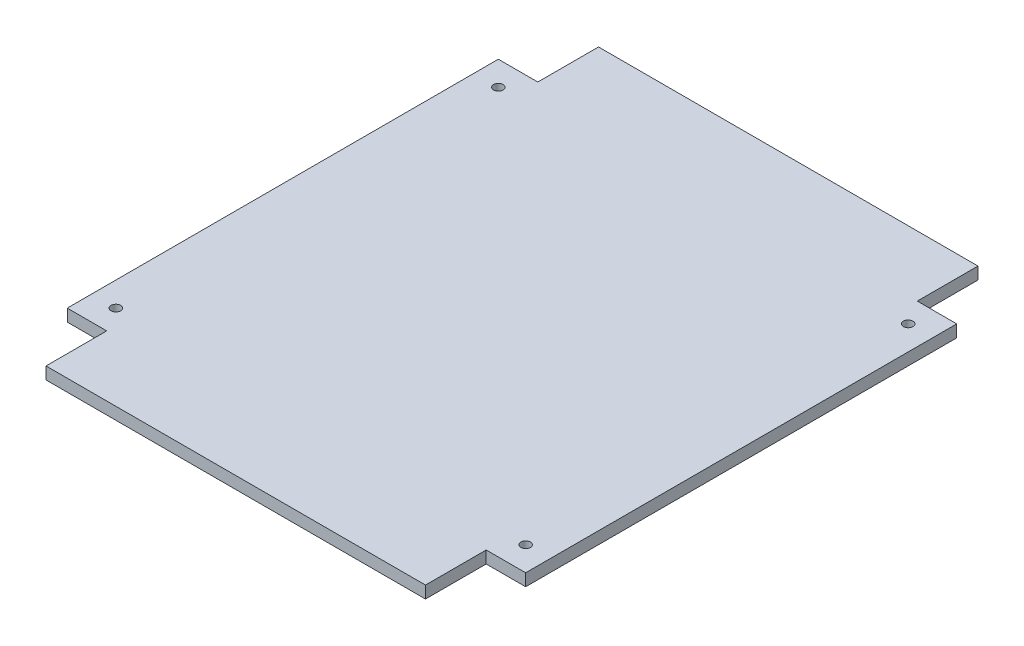
ISO-10303-21;
HEADER;
FILE_DESCRIPTION(('STEP AP214'),'2;1');
FILE_NAME('part.step','',(''),(''),'','','');
FILE_SCHEMA(('AUTOMOTIVE_DESIGN { 1 0 10303 214 1 1 1 1 }'));
ENDSEC;
DATA;
#1=APPLICATION_CONTEXT('core data for automotive mechanical design processes');
#2=APPLICATION_PROTOCOL_DEFINITION('international standard','automotive_design',2000,#1);
#3=PRODUCT_CONTEXT('',#1,'mechanical');
#4=PRODUCT('Part','Part','',(#3));
#5=PRODUCT_RELATED_PRODUCT_CATEGORY('part','',(#4));
#6=PRODUCT_DEFINITION_FORMATION('','',#4);
#7=PRODUCT_DEFINITION_CONTEXT('part definition',#1,'design');
#8=PRODUCT_DEFINITION('design','',#6,#7);
#9=PRODUCT_DEFINITION_SHAPE('','',#8);
#10=(LENGTH_UNIT() NAMED_UNIT(*) SI_UNIT(.MILLI.,.METRE.));
#11=(NAMED_UNIT(*) PLANE_ANGLE_UNIT() SI_UNIT($,.RADIAN.));
#12=(NAMED_UNIT(*) SI_UNIT($,.STERADIAN.) SOLID_ANGLE_UNIT());
#13=UNCERTAINTY_MEASURE_WITH_UNIT(LENGTH_MEASURE(1.E-05),#10,'distance_accuracy_value','');
#14=(GEOMETRIC_REPRESENTATION_CONTEXT(3) GLOBAL_UNCERTAINTY_ASSIGNED_CONTEXT((#13)) GLOBAL_UNIT_ASSIGNED_CONTEXT((#10,
#11,#12)) REPRESENTATION_CONTEXT('',''));
#15=CARTESIAN_POINT('',(0.,0.,0.));
#16=DIRECTION('',(0.,0.,1.));
#17=DIRECTION('',(1.,0.,0.));
#18=AXIS2_PLACEMENT_3D('',#15,#16,#17);
#19=CARTESIAN_POINT('',(-47.9425,2.54,45.085));
#20=DIRECTION('',(1.,0.,0.));
#21=DIRECTION('',(0.,0.,-1.));
#22=AXIS2_PLACEMENT_3D('',#19,#20,#21);
#23=PLANE('',#22);
#24=DIRECTION('',(0.,0.,1.));
#25=VECTOR('',#24,1.);
#26=CARTESIAN_POINT('',(-47.9425,0.,45.085));
#27=LINE('',#26,#25);
#28=CARTESIAN_POINT('',(-47.9425,0.,-45.085));
#29=VERTEX_POINT('',#28);
#30=CARTESIAN_POINT('',(-47.9425,0.,45.085));
#31=VERTEX_POINT('',#30);
#32=EDGE_CURVE('E157',#29,#31,#27,.T.);
#33=ORIENTED_EDGE('',*,*,#32,.T.);
#34=DIRECTION('',(0.,-1.,0.));
#35=VECTOR('',#34,1.);
#36=CARTESIAN_POINT('',(-47.9425,2.54,45.085));
#37=LINE('',#36,#35);
#38=CARTESIAN_POINT('',(-47.9425,2.54,45.085));
#39=VERTEX_POINT('',#38);
#40=EDGE_CURVE('E11',#39,#31,#37,.T.);
#41=ORIENTED_EDGE('',*,*,#40,.F.);
#42=DIRECTION('',(0.,0.,1.));
#43=VECTOR('',#42,1.);
#44=CARTESIAN_POINT('',(-47.9425,2.54,45.085));
#45=LINE('',#44,#43);
#46=CARTESIAN_POINT('',(-47.9425,2.54,-45.085));
#47=VERTEX_POINT('',#46);
#48=EDGE_CURVE('E180',#47,#39,#45,.T.);
#49=ORIENTED_EDGE('',*,*,#48,.F.);
#50=DIRECTION('',(0.,-1.,0.));
#51=VECTOR('',#50,1.);
#52=CARTESIAN_POINT('',(-47.9425,2.54,-45.085));
#53=LINE('',#52,#51);
#54=EDGE_CURVE('E153',#47,#29,#53,.T.);
#55=ORIENTED_EDGE('',*,*,#54,.T.);
#56=EDGE_LOOP('',(#33,#41,#49,#55));
#57=FACE_BOUND('',#56,.T.);
#58=ADVANCED_FACE('F37',(#57),#23,.F.);
#59=CARTESIAN_POINT('',(-47.9425,2.54,45.085));
#60=DIRECTION('',(0.,0.,-1.));
#61=DIRECTION('',(-1.,0.,0.));
#62=AXIS2_PLACEMENT_3D('',#59,#60,#61);
#63=PLANE('',#62);
#64=DIRECTION('',(1.,0.,0.));
#65=VECTOR('',#64,1.);
#66=CARTESIAN_POINT('',(-47.9425,0.,45.085));
#67=LINE('',#66,#65);
#68=CARTESIAN_POINT('',(-39.6875,0.,45.085));
#69=VERTEX_POINT('',#68);
#70=EDGE_CURVE('E160',#31,#69,#67,.T.);
#71=ORIENTED_EDGE('',*,*,#70,.T.);
#72=DIRECTION('',(0.,-1.,0.));
#73=VECTOR('',#72,1.);
#74=CARTESIAN_POINT('',(-39.6875,2.54,45.085));
#75=LINE('',#74,#73);
#76=CARTESIAN_POINT('',(-39.6875,2.54,45.085));
#77=VERTEX_POINT('',#76);
#78=EDGE_CURVE('E45',#77,#69,#75,.T.);
#79=ORIENTED_EDGE('',*,*,#78,.F.);
#80=DIRECTION('',(1.,0.,0.));
#81=VECTOR('',#80,1.);
#82=CARTESIAN_POINT('',(-47.9425,2.54,45.085));
#83=LINE('',#82,#81);
#84=EDGE_CURVE('E108',#39,#77,#83,.T.);
#85=ORIENTED_EDGE('',*,*,#84,.F.);
#86=ORIENTED_EDGE('',*,*,#40,.T.);
#87=EDGE_LOOP('',(#71,#79,#85,#86));
#88=FACE_BOUND('',#87,.T.);
#89=ADVANCED_FACE('F259',(#88),#63,.F.);
#90=CARTESIAN_POINT('',(-39.6875,2.54,45.085));
#91=DIRECTION('',(1.,0.,0.));
#92=DIRECTION('',(0.,0.,-1.));
#93=AXIS2_PLACEMENT_3D('',#90,#91,#92);
#94=PLANE('',#93);
#95=DIRECTION('',(0.,0.,1.));
#96=VECTOR('',#95,1.);
#97=CARTESIAN_POINT('',(-39.6875,0.,45.085));
#98=LINE('',#97,#96);
#99=CARTESIAN_POINT('',(-39.6875,0.,57.785));
#100=VERTEX_POINT('',#99);
#101=EDGE_CURVE('E163',#69,#100,#98,.T.);
#102=ORIENTED_EDGE('',*,*,#101,.T.);
#103=DIRECTION('',(0.,-1.,0.));
#104=VECTOR('',#103,1.);
#105=CARTESIAN_POINT('',(-39.6875,2.54,57.785));
#106=LINE('',#105,#104);
#107=CARTESIAN_POINT('',(-39.6875,2.54,57.785));
#108=VERTEX_POINT('',#107);
#109=EDGE_CURVE('E199',#108,#100,#106,.T.);
#110=ORIENTED_EDGE('',*,*,#109,.F.);
#111=DIRECTION('',(0.,0.,1.));
#112=VECTOR('',#111,1.);
#113=CARTESIAN_POINT('',(-39.6875,2.54,45.085));
#114=LINE('',#113,#112);
#115=EDGE_CURVE('E207',#77,#108,#114,.T.);
#116=ORIENTED_EDGE('',*,*,#115,.F.);
#117=ORIENTED_EDGE('',*,*,#78,.T.);
#118=EDGE_LOOP('',(#102,#110,#116,#117));
#119=FACE_BOUND('',#118,.T.);
#120=ADVANCED_FACE('F205',(#119),#94,.F.);
#121=CARTESIAN_POINT('',(39.6875,2.54,57.785));
#122=DIRECTION('',(0.,0.,-1.));
#123=DIRECTION('',(-1.,0.,0.));
#124=AXIS2_PLACEMENT_3D('',#121,#122,#123);
#125=PLANE('',#124);
#126=DIRECTION('',(1.,0.,0.));
#127=VECTOR('',#126,1.);
#128=CARTESIAN_POINT('',(39.6875,0.,57.785));
#129=LINE('',#128,#127);
#130=CARTESIAN_POINT('',(39.6875,0.,57.785));
#131=VERTEX_POINT('',#130);
#132=EDGE_CURVE('E165',#100,#131,#129,.T.);
#133=ORIENTED_EDGE('',*,*,#132,.T.);
#134=DIRECTION('',(0.,-1.,0.));
#135=VECTOR('',#134,1.);
#136=CARTESIAN_POINT('',(39.6875,2.54,57.785));
#137=LINE('',#136,#135);
#138=CARTESIAN_POINT('',(39.6875,2.54,57.785));
#139=VERTEX_POINT('',#138);
#140=EDGE_CURVE('E196',#139,#131,#137,.T.);
#141=ORIENTED_EDGE('',*,*,#140,.F.);
#142=DIRECTION('',(1.,0.,0.));
#143=VECTOR('',#142,1.);
#144=CARTESIAN_POINT('',(39.6875,2.54,57.785));
#145=LINE('',#144,#143);
#146=EDGE_CURVE('E225',#108,#139,#145,.T.);
#147=ORIENTED_EDGE('',*,*,#146,.F.);
#148=ORIENTED_EDGE('',*,*,#109,.T.);
#149=EDGE_LOOP('',(#133,#141,#147,#148));
#150=FACE_BOUND('',#149,.T.);
#151=ADVANCED_FACE('F216',(#150),#125,.F.);
#152=CARTESIAN_POINT('',(39.6875,2.54,45.085));
#153=DIRECTION('',(-1.,0.,0.));
#154=DIRECTION('',(0.,0.,1.));
#155=AXIS2_PLACEMENT_3D('',#152,#153,#154);
#156=PLANE('',#155);
#157=DIRECTION('',(0.,0.,-1.));
#158=VECTOR('',#157,1.);
#159=CARTESIAN_POINT('',(39.6875,0.,45.085));
#160=LINE('',#159,#158);
#161=CARTESIAN_POINT('',(39.6875,0.,45.085));
#162=VERTEX_POINT('',#161);
#163=EDGE_CURVE('E167',#131,#162,#160,.T.);
#164=ORIENTED_EDGE('',*,*,#163,.T.);
#165=DIRECTION('',(0.,-1.,0.));
#166=VECTOR('',#165,1.);
#167=CARTESIAN_POINT('',(39.6875,2.54,45.085));
#168=LINE('',#167,#166);
#169=CARTESIAN_POINT('',(39.6875,2.54,45.085));
#170=VERTEX_POINT('',#169);
#171=EDGE_CURVE('E193',#170,#162,#168,.T.);
#172=ORIENTED_EDGE('',*,*,#171,.F.);
#173=DIRECTION('',(0.,0.,-1.));
#174=VECTOR('',#173,1.);
#175=CARTESIAN_POINT('',(39.6875,2.54,45.085));
#176=LINE('',#175,#174);
#177=EDGE_CURVE('E222',#139,#170,#176,.T.);
#178=ORIENTED_EDGE('',*,*,#177,.F.);
#179=ORIENTED_EDGE('',*,*,#140,.T.);
#180=EDGE_LOOP('',(#164,#172,#178,#179));
#181=FACE_BOUND('',#180,.T.);
#182=ADVANCED_FACE('F220',(#181),#156,.F.);
#183=CARTESIAN_POINT('',(47.9425,2.54,45.085));
#184=DIRECTION('',(0.,0.,-1.));
#185=DIRECTION('',(-1.,0.,0.));
#186=AXIS2_PLACEMENT_3D('',#183,#184,#185);
#187=PLANE('',#186);
#188=DIRECTION('',(1.,0.,0.));
#189=VECTOR('',#188,1.);
#190=CARTESIAN_POINT('',(47.9425,0.,45.085));
#191=LINE('',#190,#189);
#192=CARTESIAN_POINT('',(47.9425,0.,45.085));
#193=VERTEX_POINT('',#192);
#194=EDGE_CURVE('E169',#162,#193,#191,.T.);
#195=ORIENTED_EDGE('',*,*,#194,.T.);
#196=DIRECTION('',(0.,-1.,0.));
#197=VECTOR('',#196,1.);
#198=CARTESIAN_POINT('',(47.9425,2.54,45.085));
#199=LINE('',#198,#197);
#200=CARTESIAN_POINT('',(47.9425,2.54,45.085));
#201=VERTEX_POINT('',#200);
#202=EDGE_CURVE('E190',#201,#193,#199,.T.);
#203=ORIENTED_EDGE('',*,*,#202,.F.);
#204=DIRECTION('',(1.,0.,0.));
#205=VECTOR('',#204,1.);
#206=CARTESIAN_POINT('',(47.9425,2.54,45.085));
#207=LINE('',#206,#205);
#208=EDGE_CURVE('E224',#170,#201,#207,.T.);
#209=ORIENTED_EDGE('',*,*,#208,.F.);
#210=ORIENTED_EDGE('',*,*,#171,.T.);
#211=EDGE_LOOP('',(#195,#203,#209,#210));
#212=FACE_BOUND('',#211,.T.);
#213=ADVANCED_FACE('F272',(#212),#187,.F.);
#214=CARTESIAN_POINT('',(47.9425,2.54,45.085));
#215=DIRECTION('',(-1.,0.,0.));
#216=DIRECTION('',(0.,0.,1.));
#217=AXIS2_PLACEMENT_3D('',#214,#215,#216);
#218=PLANE('',#217);
#219=DIRECTION('',(0.,0.,-1.));
#220=VECTOR('',#219,1.);
#221=CARTESIAN_POINT('',(47.9425,0.,45.085));
#222=LINE('',#221,#220);
#223=CARTESIAN_POINT('',(47.9425,0.,-45.085));
#224=VERTEX_POINT('',#223);
#225=EDGE_CURVE('E171',#193,#224,#222,.T.);
#226=ORIENTED_EDGE('',*,*,#225,.T.);
#227=DIRECTION('',(0.,-1.,0.));
#228=VECTOR('',#227,1.);
#229=CARTESIAN_POINT('',(47.9425,2.54,-45.085));
#230=LINE('',#229,#228);
#231=CARTESIAN_POINT('',(47.9425,2.54,-45.085));
#232=VERTEX_POINT('',#231);
#233=EDGE_CURVE('E187',#232,#224,#230,.T.);
#234=ORIENTED_EDGE('',*,*,#233,.F.);
#235=DIRECTION('',(0.,0.,-1.));
#236=VECTOR('',#235,1.);
#237=CARTESIAN_POINT('',(47.9425,2.54,45.085));
#238=LINE('',#237,#236);
#239=EDGE_CURVE('E227',#201,#232,#238,.T.);
#240=ORIENTED_EDGE('',*,*,#239,.F.);
#241=ORIENTED_EDGE('',*,*,#202,.T.);
#242=EDGE_LOOP('',(#226,#234,#240,#241));
#243=FACE_BOUND('',#242,.T.);
#244=ADVANCED_FACE('F275',(#243),#218,.F.);
#245=CARTESIAN_POINT('',(47.9425,2.54,-45.085));
#246=DIRECTION('',(0.,0.,1.));
#247=DIRECTION('',(1.,0.,0.));
#248=AXIS2_PLACEMENT_3D('',#245,#246,#247);
#249=PLANE('',#248);
#250=DIRECTION('',(-1.,0.,0.));
#251=VECTOR('',#250,1.);
#252=CARTESIAN_POINT('',(47.9425,0.,-45.085));
#253=LINE('',#252,#251);
#254=CARTESIAN_POINT('',(39.6875,0.,-45.085));
#255=VERTEX_POINT('',#254);
#256=EDGE_CURVE('E173',#224,#255,#253,.T.);
#257=ORIENTED_EDGE('',*,*,#256,.T.);
#258=DIRECTION('',(0.,-1.,0.));
#259=VECTOR('',#258,1.);
#260=CARTESIAN_POINT('',(39.6875,2.54,-45.085));
#261=LINE('',#260,#259);
#262=CARTESIAN_POINT('',(39.6875,2.54,-45.085));
#263=VERTEX_POINT('',#262);
#264=EDGE_CURVE('E184',#263,#255,#261,.T.);
#265=ORIENTED_EDGE('',*,*,#264,.F.);
#266=DIRECTION('',(-1.,0.,0.));
#267=VECTOR('',#266,1.);
#268=CARTESIAN_POINT('',(47.9425,2.54,-45.085));
#269=LINE('',#268,#267);
#270=EDGE_CURVE('E233',#232,#263,#269,.T.);
#271=ORIENTED_EDGE('',*,*,#270,.F.);
#272=ORIENTED_EDGE('',*,*,#233,.T.);
#273=EDGE_LOOP('',(#257,#265,#271,#272));
#274=FACE_BOUND('',#273,.T.);
#275=ADVANCED_FACE('F239',(#274),#249,.F.);
#276=CARTESIAN_POINT('',(39.6875,2.54,-45.085));
#277=DIRECTION('',(-1.,0.,0.));
#278=DIRECTION('',(0.,0.,1.));
#279=AXIS2_PLACEMENT_3D('',#276,#277,#278);
#280=PLANE('',#279);
#281=DIRECTION('',(0.,0.,-1.));
#282=VECTOR('',#281,1.);
#283=CARTESIAN_POINT('',(39.6875,0.,-45.085));
#284=LINE('',#283,#282);
#285=CARTESIAN_POINT('',(39.6875,0.,-57.785));
#286=VERTEX_POINT('',#285);
#287=EDGE_CURVE('E175',#255,#286,#284,.T.);
#288=ORIENTED_EDGE('',*,*,#287,.T.);
#289=DIRECTION('',(0.,-1.,0.));
#290=VECTOR('',#289,1.);
#291=CARTESIAN_POINT('',(39.6875,2.54,-57.785));
#292=LINE('',#291,#290);
#293=CARTESIAN_POINT('',(39.6875,2.54,-57.785));
#294=VERTEX_POINT('',#293);
#295=EDGE_CURVE('E148',#294,#286,#292,.T.);
#296=ORIENTED_EDGE('',*,*,#295,.F.);
#297=DIRECTION('',(0.,0.,-1.));
#298=VECTOR('',#297,1.);
#299=CARTESIAN_POINT('',(39.6875,2.54,-45.085));
#300=LINE('',#299,#298);
#301=EDGE_CURVE('E139',#263,#294,#300,.T.);
#302=ORIENTED_EDGE('',*,*,#301,.F.);
#303=ORIENTED_EDGE('',*,*,#264,.T.);
#304=EDGE_LOOP('',(#288,#296,#302,#303));
#305=FACE_BOUND('',#304,.T.);
#306=ADVANCED_FACE('F243',(#305),#280,.F.);
#307=CARTESIAN_POINT('',(39.6875,2.54,-57.785));
#308=DIRECTION('',(0.,0.,1.));
#309=DIRECTION('',(1.,0.,0.));
#310=AXIS2_PLACEMENT_3D('',#307,#308,#309);
#311=PLANE('',#310);
#312=DIRECTION('',(-1.,0.,0.));
#313=VECTOR('',#312,1.);
#314=CARTESIAN_POINT('',(39.6875,0.,-57.785));
#315=LINE('',#314,#313);
#316=CARTESIAN_POINT('',(-39.6875,0.,-57.785));
#317=VERTEX_POINT('',#316);
#318=EDGE_CURVE('E147',#286,#317,#315,.T.);
#319=ORIENTED_EDGE('',*,*,#318,.T.);
#320=DIRECTION('',(0.,-1.,0.));
#321=VECTOR('',#320,1.);
#322=CARTESIAN_POINT('',(-39.6875,2.54,-57.785));
#323=LINE('',#322,#321);
#324=CARTESIAN_POINT('',(-39.6875,2.54,-57.785));
#325=VERTEX_POINT('',#324);
#326=EDGE_CURVE('E144',#325,#317,#323,.T.);
#327=ORIENTED_EDGE('',*,*,#326,.F.);
#328=DIRECTION('',(-1.,0.,0.));
#329=VECTOR('',#328,1.);
#330=CARTESIAN_POINT('',(39.6875,2.54,-57.785));
#331=LINE('',#330,#329);
#332=EDGE_CURVE('E133',#294,#325,#331,.T.);
#333=ORIENTED_EDGE('',*,*,#332,.F.);
#334=ORIENTED_EDGE('',*,*,#295,.T.);
#335=EDGE_LOOP('',(#319,#327,#333,#334));
#336=FACE_BOUND('',#335,.T.);
#337=ADVANCED_FACE('F145',(#336),#311,.F.);
#338=CARTESIAN_POINT('',(-39.6875,2.54,-45.085));
#339=DIRECTION('',(1.,0.,0.));
#340=DIRECTION('',(0.,0.,-1.));
#341=AXIS2_PLACEMENT_3D('',#338,#339,#340);
#342=PLANE('',#341);
#343=DIRECTION('',(0.,0.,1.));
#344=VECTOR('',#343,1.);
#345=CARTESIAN_POINT('',(-39.6875,0.,-45.085));
#346=LINE('',#345,#344);
#347=CARTESIAN_POINT('',(-39.6875,0.,-45.085));
#348=VERTEX_POINT('',#347);
#349=EDGE_CURVE('E94',#317,#348,#346,.T.);
#350=ORIENTED_EDGE('',*,*,#349,.T.);
#351=DIRECTION('',(0.,-1.,0.));
#352=VECTOR('',#351,1.);
#353=CARTESIAN_POINT('',(-39.6875,2.54,-45.085));
#354=LINE('',#353,#352);
#355=CARTESIAN_POINT('',(-39.6875,2.54,-45.085));
#356=VERTEX_POINT('',#355);
#357=EDGE_CURVE('E149',#356,#348,#354,.T.);
#358=ORIENTED_EDGE('',*,*,#357,.F.);
#359=DIRECTION('',(0.,0.,1.));
#360=VECTOR('',#359,1.);
#361=CARTESIAN_POINT('',(-39.6875,2.54,-45.085));
#362=LINE('',#361,#360);
#363=EDGE_CURVE('E137',#325,#356,#362,.T.);
#364=ORIENTED_EDGE('',*,*,#363,.F.);
#365=ORIENTED_EDGE('',*,*,#326,.T.);
#366=EDGE_LOOP('',(#350,#358,#364,#365));
#367=FACE_BOUND('',#366,.T.);
#368=ADVANCED_FACE('F151',(#367),#342,.F.);
#369=CARTESIAN_POINT('',(-47.9425,2.54,-45.085));
#370=DIRECTION('',(0.,0.,1.));
#371=DIRECTION('',(1.,0.,0.));
#372=AXIS2_PLACEMENT_3D('',#369,#370,#371);
#373=PLANE('',#372);
#374=DIRECTION('',(-1.,0.,0.));
#375=VECTOR('',#374,1.);
#376=CARTESIAN_POINT('',(-47.9425,0.,-45.085));
#377=LINE('',#376,#375);
#378=EDGE_CURVE('E100',#348,#29,#377,.T.);
#379=ORIENTED_EDGE('',*,*,#378,.T.);
#380=ORIENTED_EDGE('',*,*,#54,.F.);
#381=DIRECTION('',(-1.,0.,0.));
#382=VECTOR('',#381,1.);
#383=CARTESIAN_POINT('',(-47.9425,2.54,-45.085));
#384=LINE('',#383,#382);
#385=EDGE_CURVE('E53',#356,#47,#384,.T.);
#386=ORIENTED_EDGE('',*,*,#385,.F.);
#387=ORIENTED_EDGE('',*,*,#357,.T.);
#388=EDGE_LOOP('',(#379,#380,#386,#387));
#389=FACE_BOUND('',#388,.T.);
#390=ADVANCED_FACE('F247',(#389),#373,.F.);
#391=CARTESIAN_POINT('',(-47.9425,2.54,-45.085));
#392=DIRECTION('',(0.,-1.,0.));
#393=DIRECTION('',(0.,0.,-1.));
#394=AXIS2_PLACEMENT_3D('',#391,#392,#393);
#395=PLANE('',#394);
#396=CARTESIAN_POINT('',(-42.8625,2.54,-40.005));
#397=DIRECTION('',(0.,1.,0.));
#398=DIRECTION('',(0.,0.,1.));
#399=AXIS2_PLACEMENT_3D('',#396,#397,#398);
#400=CIRCLE('',#399,0.999490000000001);
#401=CARTESIAN_POINT('',(-42.8625,2.54,-39.00551));
#402=VERTEX_POINT('',#401);
#403=EDGE_CURVE('E387',#402,#402,#400,.T.);
#404=ORIENTED_EDGE('',*,*,#403,.F.);
#405=EDGE_LOOP('',(#404));
#406=FACE_BOUND('',#405,.T.);
#407=CARTESIAN_POINT('',(-42.8625,2.54,40.005));
#408=DIRECTION('',(0.,1.,0.));
#409=DIRECTION('',(0.,0.,1.));
#410=AXIS2_PLACEMENT_3D('',#407,#408,#409);
#411=CIRCLE('',#410,0.999490000000001);
#412=CARTESIAN_POINT('',(-42.8625,2.54,41.00449));
#413=VERTEX_POINT('',#412);
#414=EDGE_CURVE('E389',#413,#413,#411,.T.);
#415=ORIENTED_EDGE('',*,*,#414,.F.);
#416=EDGE_LOOP('',(#415));
#417=FACE_BOUND('',#416,.T.);
#418=CARTESIAN_POINT('',(42.8625,2.54,-40.005));
#419=DIRECTION('',(0.,1.,0.));
#420=DIRECTION('',(0.,0.,1.));
#421=AXIS2_PLACEMENT_3D('',#418,#419,#420);
#422=CIRCLE('',#421,0.999490000000001);
#423=CARTESIAN_POINT('',(42.8625,2.54,-39.00551));
#424=VERTEX_POINT('',#423);
#425=EDGE_CURVE('E395',#424,#424,#422,.T.);
#426=ORIENTED_EDGE('',*,*,#425,.F.);
#427=EDGE_LOOP('',(#426));
#428=FACE_BOUND('',#427,.T.);
#429=CARTESIAN_POINT('',(42.8625,2.54,40.005));
#430=DIRECTION('',(0.,1.,0.));
#431=DIRECTION('',(0.,0.,1.));
#432=AXIS2_PLACEMENT_3D('',#429,#430,#431);
#433=CIRCLE('',#432,0.999490000000001);
#434=CARTESIAN_POINT('',(42.8625,2.54,41.00449));
#435=VERTEX_POINT('',#434);
#436=EDGE_CURVE('E401',#435,#435,#433,.T.);
#437=ORIENTED_EDGE('',*,*,#436,.F.);
#438=EDGE_LOOP('',(#437));
#439=FACE_BOUND('',#438,.T.);
#440=ORIENTED_EDGE('',*,*,#48,.T.);
#441=ORIENTED_EDGE('',*,*,#84,.T.);
#442=ORIENTED_EDGE('',*,*,#115,.T.);
#443=ORIENTED_EDGE('',*,*,#146,.T.);
#444=ORIENTED_EDGE('',*,*,#177,.T.);
#445=ORIENTED_EDGE('',*,*,#208,.T.);
#446=ORIENTED_EDGE('',*,*,#239,.T.);
#447=ORIENTED_EDGE('',*,*,#270,.T.);
#448=ORIENTED_EDGE('',*,*,#301,.T.);
#449=ORIENTED_EDGE('',*,*,#332,.T.);
#450=ORIENTED_EDGE('',*,*,#363,.T.);
#451=ORIENTED_EDGE('',*,*,#385,.T.);
#452=EDGE_LOOP('',(#440,#441,#442,#443,#444,#445,#446,#447,#448,#449,#450,#451));
#453=FACE_BOUND('',#452,.T.);
#454=ADVANCED_FACE('F135',(#406,#417,#428,#439,#453),#395,.F.);
#455=CARTESIAN_POINT('',(-47.9425,0.,-45.085));
#456=DIRECTION('',(0.,-1.,0.));
#457=DIRECTION('',(0.,0.,-1.));
#458=AXIS2_PLACEMENT_3D('',#455,#456,#457);
#459=PLANE('',#458);
#460=CARTESIAN_POINT('',(-42.8625,0.,-40.005));
#461=DIRECTION('',(0.,1.,0.));
#462=DIRECTION('',(0.,0.,1.));
#463=AXIS2_PLACEMENT_3D('',#460,#461,#462);
#464=CIRCLE('',#463,0.999490000000001);
#465=CARTESIAN_POINT('',(-42.8625,0.,-39.00551));
#466=VERTEX_POINT('',#465);
#467=EDGE_CURVE('E384',#466,#466,#464,.T.);
#468=ORIENTED_EDGE('',*,*,#467,.T.);
#469=EDGE_LOOP('',(#468));
#470=FACE_BOUND('',#469,.T.);
#471=CARTESIAN_POINT('',(-42.8625,0.,40.005));
#472=DIRECTION('',(0.,1.,0.));
#473=DIRECTION('',(0.,0.,1.));
#474=AXIS2_PLACEMENT_3D('',#471,#472,#473);
#475=CIRCLE('',#474,0.999490000000001);
#476=CARTESIAN_POINT('',(-42.8625,0.,41.00449));
#477=VERTEX_POINT('',#476);
#478=EDGE_CURVE('E392',#477,#477,#475,.T.);
#479=ORIENTED_EDGE('',*,*,#478,.T.);
#480=EDGE_LOOP('',(#479));
#481=FACE_BOUND('',#480,.T.);
#482=CARTESIAN_POINT('',(42.8625,0.,-40.005));
#483=DIRECTION('',(0.,1.,0.));
#484=DIRECTION('',(0.,0.,1.));
#485=AXIS2_PLACEMENT_3D('',#482,#483,#484);
#486=CIRCLE('',#485,0.999490000000001);
#487=CARTESIAN_POINT('',(42.8625,0.,-39.00551));
#488=VERTEX_POINT('',#487);
#489=EDGE_CURVE('E398',#488,#488,#486,.T.);
#490=ORIENTED_EDGE('',*,*,#489,.T.);
#491=EDGE_LOOP('',(#490));
#492=FACE_BOUND('',#491,.T.);
#493=CARTESIAN_POINT('',(42.8625,0.,40.005));
#494=DIRECTION('',(0.,1.,0.));
#495=DIRECTION('',(0.,0.,1.));
#496=AXIS2_PLACEMENT_3D('',#493,#494,#495);
#497=CIRCLE('',#496,0.999490000000001);
#498=CARTESIAN_POINT('',(42.8625,0.,41.00449));
#499=VERTEX_POINT('',#498);
#500=EDGE_CURVE('E161',#499,#499,#497,.T.);
#501=ORIENTED_EDGE('',*,*,#500,.T.);
#502=EDGE_LOOP('',(#501));
#503=FACE_BOUND('',#502,.T.);
#504=ORIENTED_EDGE('',*,*,#32,.F.);
#505=ORIENTED_EDGE('',*,*,#378,.F.);
#506=ORIENTED_EDGE('',*,*,#349,.F.);
#507=ORIENTED_EDGE('',*,*,#318,.F.);
#508=ORIENTED_EDGE('',*,*,#287,.F.);
#509=ORIENTED_EDGE('',*,*,#256,.F.);
#510=ORIENTED_EDGE('',*,*,#225,.F.);
#511=ORIENTED_EDGE('',*,*,#194,.F.);
#512=ORIENTED_EDGE('',*,*,#163,.F.);
#513=ORIENTED_EDGE('',*,*,#132,.F.);
#514=ORIENTED_EDGE('',*,*,#101,.F.);
#515=ORIENTED_EDGE('',*,*,#70,.F.);
#516=EDGE_LOOP('',(#504,#505,#506,#507,#508,#509,#510,#511,#512,#513,#514,#515));
#517=FACE_BOUND('',#516,.T.);
#518=ADVANCED_FACE('F211',(#470,#481,#492,#503,#517),#459,.T.);
#519=CARTESIAN_POINT('',(42.8625,0.,40.005));
#520=DIRECTION('',(0.,1.,0.));
#521=DIRECTION('',(0.,0.,1.));
#522=AXIS2_PLACEMENT_3D('',#519,#520,#521);
#523=CYLINDRICAL_SURFACE('',#522,0.999490000000001);
#524=ORIENTED_EDGE('',*,*,#500,.F.);
#525=EDGE_LOOP('',(#524));
#526=FACE_BOUND('',#525,.T.);
#527=ORIENTED_EDGE('',*,*,#436,.T.);
#528=EDGE_LOOP('',(#527));
#529=FACE_BOUND('',#528,.T.);
#530=ADVANCED_FACE('F323',(#526,#529),#523,.F.);
#531=CARTESIAN_POINT('',(42.8625,0.,-40.005));
#532=DIRECTION('',(0.,1.,0.));
#533=DIRECTION('',(0.,0.,1.));
#534=AXIS2_PLACEMENT_3D('',#531,#532,#533);
#535=CYLINDRICAL_SURFACE('',#534,0.999490000000001);
#536=ORIENTED_EDGE('',*,*,#489,.F.);
#537=EDGE_LOOP('',(#536));
#538=FACE_BOUND('',#537,.T.);
#539=ORIENTED_EDGE('',*,*,#425,.T.);
#540=EDGE_LOOP('',(#539));
#541=FACE_BOUND('',#540,.T.);
#542=ADVANCED_FACE('F347',(#538,#541),#535,.F.);
#543=CARTESIAN_POINT('',(-42.8625,0.,40.005));
#544=DIRECTION('',(0.,1.,0.));
#545=DIRECTION('',(0.,0.,1.));
#546=AXIS2_PLACEMENT_3D('',#543,#544,#545);
#547=CYLINDRICAL_SURFACE('',#546,0.999490000000001);
#548=ORIENTED_EDGE('',*,*,#478,.F.);
#549=EDGE_LOOP('',(#548));
#550=FACE_BOUND('',#549,.T.);
#551=ORIENTED_EDGE('',*,*,#414,.T.);
#552=EDGE_LOOP('',(#551));
#553=FACE_BOUND('',#552,.T.);
#554=ADVANCED_FACE('F357',(#550,#553),#547,.F.);
#555=CARTESIAN_POINT('',(-42.8625,0.,-40.005));
#556=DIRECTION('',(0.,1.,0.));
#557=DIRECTION('',(0.,0.,1.));
#558=AXIS2_PLACEMENT_3D('',#555,#556,#557);
#559=CYLINDRICAL_SURFACE('',#558,0.999490000000001);
#560=ORIENTED_EDGE('',*,*,#467,.F.);
#561=EDGE_LOOP('',(#560));
#562=FACE_BOUND('',#561,.T.);
#563=ORIENTED_EDGE('',*,*,#403,.T.);
#564=EDGE_LOOP('',(#563));
#565=FACE_BOUND('',#564,.T.);
#566=ADVANCED_FACE('F367',(#562,#565),#559,.F.);
#567=CLOSED_SHELL('',(#58,#89,#120,#151,#182,#213,#244,#275,#306,#337,#368,#390,#454,#518,#530,
#542,#554,#566));
#568=MANIFOLD_SOLID_BREP('B2',#567);
#569=ADVANCED_BREP_SHAPE_REPRESENTATION('',(#18,#568),#14);
#570=SHAPE_DEFINITION_REPRESENTATION(#9,#569);
ENDSEC;
END-ISO-10303-21;
